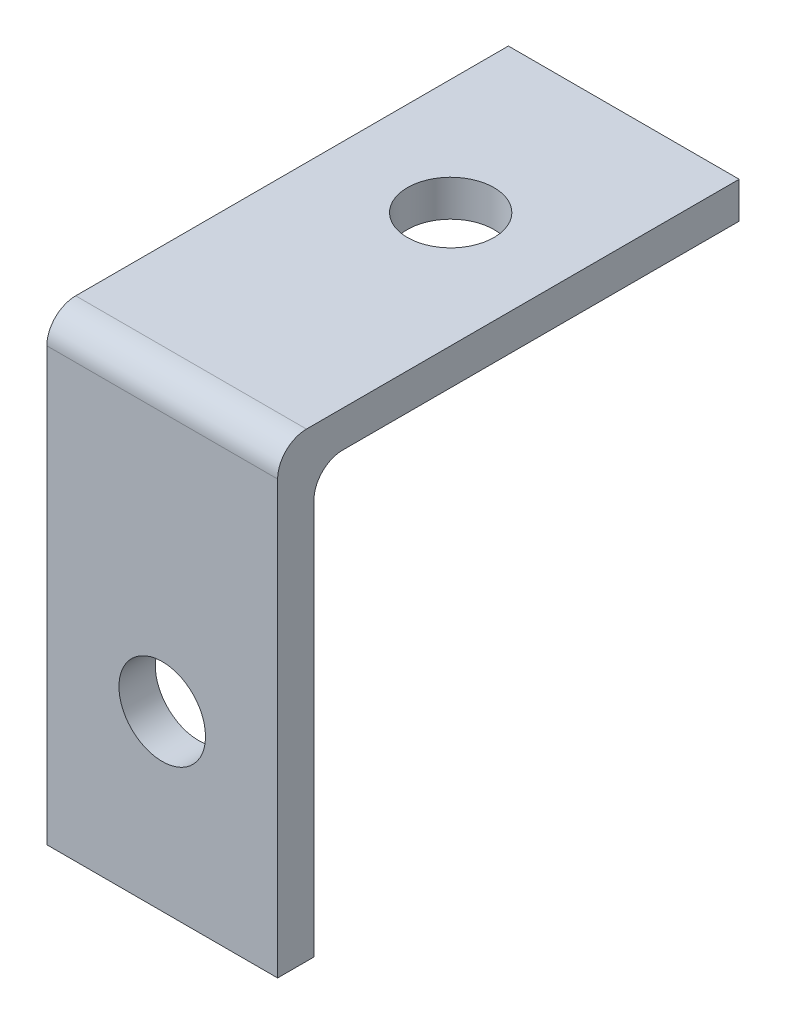
ISO-10303-21;
HEADER;
FILE_DESCRIPTION(('STEP AP214'),'2;1');
FILE_NAME('part.step','',(''),(''),'','','');
FILE_SCHEMA(('AUTOMOTIVE_DESIGN { 1 0 10303 214 1 1 1 1 }'));
ENDSEC;
DATA;
#1=APPLICATION_CONTEXT('core data for automotive mechanical design processes');
#2=APPLICATION_PROTOCOL_DEFINITION('international standard','automotive_design',2000,#1);
#3=PRODUCT_CONTEXT('',#1,'mechanical');
#4=PRODUCT('Part','Part','',(#3));
#5=PRODUCT_RELATED_PRODUCT_CATEGORY('part','',(#4));
#6=PRODUCT_DEFINITION_FORMATION('','',#4);
#7=PRODUCT_DEFINITION_CONTEXT('part definition',#1,'design');
#8=PRODUCT_DEFINITION('design','',#6,#7);
#9=PRODUCT_DEFINITION_SHAPE('','',#8);
#10=(LENGTH_UNIT() NAMED_UNIT(*) SI_UNIT(.MILLI.,.METRE.));
#11=(NAMED_UNIT(*) PLANE_ANGLE_UNIT() SI_UNIT($,.RADIAN.));
#12=(NAMED_UNIT(*) SI_UNIT($,.STERADIAN.) SOLID_ANGLE_UNIT());
#13=UNCERTAINTY_MEASURE_WITH_UNIT(LENGTH_MEASURE(1.E-05),#10,'distance_accuracy_value','');
#14=(GEOMETRIC_REPRESENTATION_CONTEXT(3) GLOBAL_UNCERTAINTY_ASSIGNED_CONTEXT((#13)) GLOBAL_UNIT_ASSIGNED_CONTEXT((#10,
#11,#12)) REPRESENTATION_CONTEXT('',''));
#15=CARTESIAN_POINT('',(0.,0.,0.));
#16=DIRECTION('',(0.,0.,1.));
#17=DIRECTION('',(1.,0.,0.));
#18=AXIS2_PLACEMENT_3D('',#15,#16,#17);
#19=CARTESIAN_POINT('',(0.,0.,0.));
#20=DIRECTION('',(0.,1.,0.));
#21=DIRECTION('',(0.,0.,1.));
#22=AXIS2_PLACEMENT_3D('',#19,#20,#21);
#23=PLANE('',#22);
#24=CARTESIAN_POINT('',(0.,0.,-3.175));
#25=DIRECTION('',(0.,1.,0.));
#26=DIRECTION('',(0.,0.,1.));
#27=AXIS2_PLACEMENT_3D('',#24,#25,#26);
#28=CIRCLE('',#27,2.38125);
#29=CARTESIAN_POINT('',(0.,0.,-0.793750000000001));
#30=VERTEX_POINT('',#29);
#31=EDGE_CURVE('E119',#30,#30,#28,.T.);
#32=ORIENTED_EDGE('',*,*,#31,.T.);
#33=EDGE_LOOP('',(#32));
#34=FACE_BOUND('',#33,.T.);
#35=DIRECTION('',(0.,0.,-1.));
#36=VECTOR('',#35,1.);
#37=CARTESIAN_POINT('',(6.34999999999999,0.,-12.7));
#38=LINE('',#37,#36);
#39=CARTESIAN_POINT('',(6.35,0.,9.11249999999999));
#40=VERTEX_POINT('',#39);
#41=CARTESIAN_POINT('',(6.34999999999999,0.,-12.7));
#42=VERTEX_POINT('',#41);
#43=EDGE_CURVE('E122',#40,#42,#38,.T.);
#44=ORIENTED_EDGE('',*,*,#43,.F.);
#45=DIRECTION('',(1.,0.,0.));
#46=VECTOR('',#45,1.);
#47=CARTESIAN_POINT('',(-6.35,0.,9.11249999999999));
#48=LINE('',#47,#46);
#49=CARTESIAN_POINT('',(-6.35,0.,9.11249999999999));
#50=VERTEX_POINT('',#49);
#51=EDGE_CURVE('E55',#40,#50,#48,.F.);
#52=ORIENTED_EDGE('',*,*,#51,.T.);
#53=DIRECTION('',(0.,0.,1.));
#54=VECTOR('',#53,1.);
#55=CARTESIAN_POINT('',(-6.35000000000001,0.,-12.7));
#56=LINE('',#55,#54);
#57=CARTESIAN_POINT('',(-6.35000000000001,0.,-12.7));
#58=VERTEX_POINT('',#57);
#59=EDGE_CURVE('E132',#58,#50,#56,.T.);
#60=ORIENTED_EDGE('',*,*,#59,.F.);
#61=DIRECTION('',(-1.,0.,0.));
#62=VECTOR('',#61,1.);
#63=CARTESIAN_POINT('',(-6.35000000000001,0.,-12.7));
#64=LINE('',#63,#62);
#65=EDGE_CURVE('E124',#42,#58,#64,.T.);
#66=ORIENTED_EDGE('',*,*,#65,.F.);
#67=EDGE_LOOP('',(#44,#52,#60,#66));
#68=FACE_BOUND('',#67,.T.);
#69=ADVANCED_FACE('F33',(#34,#68),#23,.F.);
#70=CARTESIAN_POINT('',(6.34999999999999,2.,-12.7));
#71=DIRECTION('',(-1.,0.,0.));
#72=DIRECTION('',(0.,0.,1.));
#73=AXIS2_PLACEMENT_3D('',#70,#71,#72);
#74=PLANE('',#73);
#75=DIRECTION('',(0.,0.,-1.));
#76=VECTOR('',#75,1.);
#77=CARTESIAN_POINT('',(6.34999999999999,2.,-12.7));
#78=LINE('',#77,#76);
#79=CARTESIAN_POINT('',(6.35,2.,11.1125));
#80=VERTEX_POINT('',#79);
#81=CARTESIAN_POINT('',(6.34999999999999,2.,-12.7));
#82=VERTEX_POINT('',#81);
#83=EDGE_CURVE('E129',#80,#82,#78,.T.);
#84=ORIENTED_EDGE('',*,*,#83,.F.);
#85=CARTESIAN_POINT('',(6.35,0.4125,11.1125));
#86=DIRECTION('',(-1.,0.,0.));
#87=DIRECTION('',(0.,0.,1.));
#88=AXIS2_PLACEMENT_3D('',#85,#86,#87);
#89=CIRCLE('',#88,1.5875);
#90=CARTESIAN_POINT('',(6.35,0.4125,12.7));
#91=VERTEX_POINT('',#90);
#92=EDGE_CURVE('E152',#80,#91,#89,.F.);
#93=ORIENTED_EDGE('',*,*,#92,.T.);
#94=DIRECTION('',(0.,-1.,0.));
#95=VECTOR('',#94,1.);
#96=CARTESIAN_POINT('',(6.35,2.,12.7));
#97=LINE('',#96,#95);
#98=CARTESIAN_POINT('',(6.35,-23.368,12.7));
#99=VERTEX_POINT('',#98);
#100=EDGE_CURVE('E136',#91,#99,#97,.T.);
#101=ORIENTED_EDGE('',*,*,#100,.T.);
#102=DIRECTION('',(0.,0.,1.));
#103=VECTOR('',#102,1.);
#104=CARTESIAN_POINT('',(6.35,-23.368,12.7));
#105=LINE('',#104,#103);
#106=CARTESIAN_POINT('',(6.35,-23.368,10.7));
#107=VERTEX_POINT('',#106);
#108=EDGE_CURVE('E110',#107,#99,#105,.T.);
#109=ORIENTED_EDGE('',*,*,#108,.F.);
#110=DIRECTION('',(0.,1.,0.));
#111=VECTOR('',#110,1.);
#112=CARTESIAN_POINT('',(6.35,-23.368,10.7));
#113=LINE('',#112,#111);
#114=CARTESIAN_POINT('',(6.35,-1.5875,10.7));
#115=VERTEX_POINT('',#114);
#116=EDGE_CURVE('E106',#107,#115,#113,.T.);
#117=ORIENTED_EDGE('',*,*,#116,.T.);
#118=CARTESIAN_POINT('',(6.35,-1.5875,9.11249999999999));
#119=DIRECTION('',(-1.,0.,0.));
#120=DIRECTION('',(0.,0.,1.));
#121=AXIS2_PLACEMENT_3D('',#118,#119,#120);
#122=CIRCLE('',#121,1.5875);
#123=EDGE_CURVE('E42',#115,#40,#122,.T.);
#124=ORIENTED_EDGE('',*,*,#123,.T.);
#125=ORIENTED_EDGE('',*,*,#43,.T.);
#126=DIRECTION('',(0.,-1.,0.));
#127=VECTOR('',#126,1.);
#128=CARTESIAN_POINT('',(6.34999999999999,2.,-12.7));
#129=LINE('',#128,#127);
#130=EDGE_CURVE('E146',#82,#42,#129,.T.);
#131=ORIENTED_EDGE('',*,*,#130,.F.);
#132=EDGE_LOOP('',(#84,#93,#101,#109,#117,#124,#125,#131));
#133=FACE_BOUND('',#132,.T.);
#134=ADVANCED_FACE('F163',(#133),#74,.F.);
#135=CARTESIAN_POINT('',(-6.35000000000001,2.,-12.7));
#136=DIRECTION('',(0.,0.,1.));
#137=DIRECTION('',(1.,0.,0.));
#138=AXIS2_PLACEMENT_3D('',#135,#136,#137);
#139=PLANE('',#138);
#140=ORIENTED_EDGE('',*,*,#65,.T.);
#141=DIRECTION('',(0.,-1.,0.));
#142=VECTOR('',#141,1.);
#143=CARTESIAN_POINT('',(-6.35000000000001,2.,-12.7));
#144=LINE('',#143,#142);
#145=CARTESIAN_POINT('',(-6.35000000000001,2.,-12.7));
#146=VERTEX_POINT('',#145);
#147=EDGE_CURVE('E143',#146,#58,#144,.T.);
#148=ORIENTED_EDGE('',*,*,#147,.F.);
#149=DIRECTION('',(-1.,0.,0.));
#150=VECTOR('',#149,1.);
#151=CARTESIAN_POINT('',(-6.35000000000001,2.,-12.7));
#152=LINE('',#151,#150);
#153=EDGE_CURVE('E131',#82,#146,#152,.T.);
#154=ORIENTED_EDGE('',*,*,#153,.F.);
#155=ORIENTED_EDGE('',*,*,#130,.T.);
#156=EDGE_LOOP('',(#140,#148,#154,#155));
#157=FACE_BOUND('',#156,.T.);
#158=ADVANCED_FACE('F184',(#157),#139,.F.);
#159=CARTESIAN_POINT('',(-6.35000000000001,2.,-12.7));
#160=DIRECTION('',(1.,0.,0.));
#161=DIRECTION('',(0.,0.,-1.));
#162=AXIS2_PLACEMENT_3D('',#159,#160,#161);
#163=PLANE('',#162);
#164=DIRECTION('',(0.,-1.,0.));
#165=VECTOR('',#164,1.);
#166=CARTESIAN_POINT('',(-6.35,2.,12.7));
#167=LINE('',#166,#165);
#168=CARTESIAN_POINT('',(-6.35,0.4125,12.7));
#169=VERTEX_POINT('',#168);
#170=CARTESIAN_POINT('',(-6.35,-23.368,12.7));
#171=VERTEX_POINT('',#170);
#172=EDGE_CURVE('E141',#169,#171,#167,.T.);
#173=ORIENTED_EDGE('',*,*,#172,.F.);
#174=CARTESIAN_POINT('',(-6.35,0.4125,11.1125));
#175=DIRECTION('',(1.,0.,0.));
#176=DIRECTION('',(0.,0.,-1.));
#177=AXIS2_PLACEMENT_3D('',#174,#175,#176);
#178=CIRCLE('',#177,1.5875);
#179=CARTESIAN_POINT('',(-6.35,2.,11.1125));
#180=VERTEX_POINT('',#179);
#181=EDGE_CURVE('E156',#169,#180,#178,.F.);
#182=ORIENTED_EDGE('',*,*,#181,.T.);
#183=DIRECTION('',(0.,0.,1.));
#184=VECTOR('',#183,1.);
#185=CARTESIAN_POINT('',(-6.35000000000001,2.,-12.7));
#186=LINE('',#185,#184);
#187=EDGE_CURVE('E134',#146,#180,#186,.T.);
#188=ORIENTED_EDGE('',*,*,#187,.F.);
#189=ORIENTED_EDGE('',*,*,#147,.T.);
#190=ORIENTED_EDGE('',*,*,#59,.T.);
#191=CARTESIAN_POINT('',(-6.35,-1.5875,9.11249999999999));
#192=DIRECTION('',(1.,0.,0.));
#193=DIRECTION('',(0.,0.,-1.));
#194=AXIS2_PLACEMENT_3D('',#191,#192,#193);
#195=CIRCLE('',#194,1.5875);
#196=CARTESIAN_POINT('',(-6.35,-1.5875,10.7));
#197=VERTEX_POINT('',#196);
#198=EDGE_CURVE('E12',#50,#197,#195,.T.);
#199=ORIENTED_EDGE('',*,*,#198,.T.);
#200=DIRECTION('',(0.,1.,0.));
#201=VECTOR('',#200,1.);
#202=CARTESIAN_POINT('',(-6.35,-23.368,10.7));
#203=LINE('',#202,#201);
#204=CARTESIAN_POINT('',(-6.35,-23.368,10.7));
#205=VERTEX_POINT('',#204);
#206=EDGE_CURVE('E103',#205,#197,#203,.T.);
#207=ORIENTED_EDGE('',*,*,#206,.F.);
#208=DIRECTION('',(0.,0.,-1.));
#209=VECTOR('',#208,1.);
#210=CARTESIAN_POINT('',(-6.35,-23.368,12.7));
#211=LINE('',#210,#209);
#212=EDGE_CURVE('E111',#171,#205,#211,.T.);
#213=ORIENTED_EDGE('',*,*,#212,.F.);
#214=EDGE_LOOP('',(#173,#182,#188,#189,#190,#199,#207,#213));
#215=FACE_BOUND('',#214,.T.);
#216=ADVANCED_FACE('F121',(#215),#163,.F.);
#217=CARTESIAN_POINT('',(-6.35,2.,12.7));
#218=DIRECTION('',(0.,0.,-1.));
#219=DIRECTION('',(-1.,0.,0.));
#220=AXIS2_PLACEMENT_3D('',#217,#218,#219);
#221=PLANE('',#220);
#222=CARTESIAN_POINT('',(0.,-13.843,12.7));
#223=DIRECTION('',(0.,0.,1.));
#224=DIRECTION('',(1.,0.,0.));
#225=AXIS2_PLACEMENT_3D('',#222,#223,#224);
#226=CIRCLE('',#225,2.38125);
#227=CARTESIAN_POINT('',(2.38125,-13.843,12.7));
#228=VERTEX_POINT('',#227);
#229=EDGE_CURVE('E216',#228,#228,#226,.T.);
#230=ORIENTED_EDGE('',*,*,#229,.F.);
#231=EDGE_LOOP('',(#230));
#232=FACE_BOUND('',#231,.T.);
#233=ORIENTED_EDGE('',*,*,#100,.F.);
#234=DIRECTION('',(1.,0.,0.));
#235=VECTOR('',#234,1.);
#236=CARTESIAN_POINT('',(-6.35,0.4125,12.7));
#237=LINE('',#236,#235);
#238=EDGE_CURVE('E154',#91,#169,#237,.F.);
#239=ORIENTED_EDGE('',*,*,#238,.T.);
#240=ORIENTED_EDGE('',*,*,#172,.T.);
#241=DIRECTION('',(-1.,0.,0.));
#242=VECTOR('',#241,1.);
#243=CARTESIAN_POINT('',(-6.35,-23.368,12.7));
#244=LINE('',#243,#242);
#245=EDGE_CURVE('E117',#99,#171,#244,.T.);
#246=ORIENTED_EDGE('',*,*,#245,.F.);
#247=EDGE_LOOP('',(#233,#239,#240,#246));
#248=FACE_BOUND('',#247,.T.);
#249=ADVANCED_FACE('F191',(#232,#248),#221,.F.);
#250=CARTESIAN_POINT('',(0.,2.,0.));
#251=DIRECTION('',(0.,1.,0.));
#252=DIRECTION('',(0.,0.,1.));
#253=AXIS2_PLACEMENT_3D('',#250,#251,#252);
#254=PLANE('',#253);
#255=CARTESIAN_POINT('',(0.,2.,-3.175));
#256=DIRECTION('',(0.,1.,0.));
#257=DIRECTION('',(0.,0.,1.));
#258=AXIS2_PLACEMENT_3D('',#255,#256,#257);
#259=CIRCLE('',#258,2.38125);
#260=CARTESIAN_POINT('',(0.,2.,-0.793750000000001));
#261=VERTEX_POINT('',#260);
#262=EDGE_CURVE('E213',#261,#261,#259,.T.);
#263=ORIENTED_EDGE('',*,*,#262,.F.);
#264=EDGE_LOOP('',(#263));
#265=FACE_BOUND('',#264,.T.);
#266=ORIENTED_EDGE('',*,*,#187,.T.);
#267=DIRECTION('',(1.,0.,0.));
#268=VECTOR('',#267,1.);
#269=CARTESIAN_POINT('',(6.35,2.,11.1125));
#270=LINE('',#269,#268);
#271=EDGE_CURVE('E149',#180,#80,#270,.T.);
#272=ORIENTED_EDGE('',*,*,#271,.T.);
#273=ORIENTED_EDGE('',*,*,#83,.T.);
#274=ORIENTED_EDGE('',*,*,#153,.T.);
#275=EDGE_LOOP('',(#266,#272,#273,#274));
#276=FACE_BOUND('',#275,.T.);
#277=ADVANCED_FACE('F189',(#265,#276),#254,.T.);
#278=CARTESIAN_POINT('',(-6.35,-23.368,10.7));
#279=DIRECTION('',(0.,0.,1.));
#280=DIRECTION('',(1.,0.,0.));
#281=AXIS2_PLACEMENT_3D('',#278,#279,#280);
#282=PLANE('',#281);
#283=CARTESIAN_POINT('',(0.,-13.843,10.7));
#284=DIRECTION('',(0.,0.,1.));
#285=DIRECTION('',(1.,0.,0.));
#286=AXIS2_PLACEMENT_3D('',#283,#284,#285);
#287=CIRCLE('',#286,2.38125);
#288=CARTESIAN_POINT('',(2.38125,-13.843,10.7));
#289=VERTEX_POINT('',#288);
#290=EDGE_CURVE('E37',#289,#289,#287,.T.);
#291=ORIENTED_EDGE('',*,*,#290,.T.);
#292=EDGE_LOOP('',(#291));
#293=FACE_BOUND('',#292,.T.);
#294=ORIENTED_EDGE('',*,*,#206,.T.);
#295=DIRECTION('',(1.,0.,0.));
#296=VECTOR('',#295,1.);
#297=CARTESIAN_POINT('',(6.35,-1.5875,10.7));
#298=LINE('',#297,#296);
#299=EDGE_CURVE('E158',#197,#115,#298,.T.);
#300=ORIENTED_EDGE('',*,*,#299,.T.);
#301=ORIENTED_EDGE('',*,*,#116,.F.);
#302=DIRECTION('',(1.,0.,0.));
#303=VECTOR('',#302,1.);
#304=CARTESIAN_POINT('',(-6.35,-23.368,10.7));
#305=LINE('',#304,#303);
#306=EDGE_CURVE('E99',#205,#107,#305,.T.);
#307=ORIENTED_EDGE('',*,*,#306,.F.);
#308=EDGE_LOOP('',(#294,#300,#301,#307));
#309=FACE_BOUND('',#308,.T.);
#310=ADVANCED_FACE('F101',(#293,#309),#282,.F.);
#311=CARTESIAN_POINT('',(0.,-23.368,0.));
#312=DIRECTION('',(0.,-1.,0.));
#313=DIRECTION('',(0.,0.,-1.));
#314=AXIS2_PLACEMENT_3D('',#311,#312,#313);
#315=PLANE('',#314);
#316=ORIENTED_EDGE('',*,*,#212,.T.);
#317=ORIENTED_EDGE('',*,*,#306,.T.);
#318=ORIENTED_EDGE('',*,*,#108,.T.);
#319=ORIENTED_EDGE('',*,*,#245,.T.);
#320=EDGE_LOOP('',(#316,#317,#318,#319));
#321=FACE_BOUND('',#320,.T.);
#322=ADVANCED_FACE('F115',(#321),#315,.T.);
#323=CARTESIAN_POINT('',(0.,0.4125,11.1125));
#324=DIRECTION('',(-1.,0.,0.));
#325=DIRECTION('',(0.,0.,1.));
#326=AXIS2_PLACEMENT_3D('',#323,#324,#325);
#327=CYLINDRICAL_SURFACE('',#326,1.5875);
#328=ORIENTED_EDGE('',*,*,#181,.F.);
#329=ORIENTED_EDGE('',*,*,#238,.F.);
#330=ORIENTED_EDGE('',*,*,#92,.F.);
#331=ORIENTED_EDGE('',*,*,#271,.F.);
#332=EDGE_LOOP('',(#328,#329,#330,#331));
#333=FACE_BOUND('',#332,.T.);
#334=ADVANCED_FACE('F169',(#333),#327,.T.);
#335=CARTESIAN_POINT('',(-6.35,-1.5875,9.11249999999999));
#336=DIRECTION('',(-1.,0.,0.));
#337=DIRECTION('',(0.,0.,1.));
#338=AXIS2_PLACEMENT_3D('',#335,#336,#337);
#339=CYLINDRICAL_SURFACE('',#338,1.5875);
#340=ORIENTED_EDGE('',*,*,#198,.F.);
#341=ORIENTED_EDGE('',*,*,#51,.F.);
#342=ORIENTED_EDGE('',*,*,#123,.F.);
#343=ORIENTED_EDGE('',*,*,#299,.F.);
#344=EDGE_LOOP('',(#340,#341,#342,#343));
#345=FACE_BOUND('',#344,.T.);
#346=ADVANCED_FACE('F35',(#345),#339,.F.);
#347=CARTESIAN_POINT('',(0.,-23.368,-3.175));
#348=DIRECTION('',(0.,1.,0.));
#349=DIRECTION('',(0.,0.,1.));
#350=AXIS2_PLACEMENT_3D('',#347,#348,#349);
#351=CYLINDRICAL_SURFACE('',#350,2.38125);
#352=ORIENTED_EDGE('',*,*,#262,.T.);
#353=EDGE_LOOP('',(#352));
#354=FACE_BOUND('',#353,.T.);
#355=ORIENTED_EDGE('',*,*,#31,.F.);
#356=EDGE_LOOP('',(#355));
#357=FACE_BOUND('',#356,.T.);
#358=ADVANCED_FACE('F168',(#354,#357),#351,.F.);
#359=CARTESIAN_POINT('',(0.,-13.843,10.16));
#360=DIRECTION('',(0.,0.,1.));
#361=DIRECTION('',(1.,0.,0.));
#362=AXIS2_PLACEMENT_3D('',#359,#360,#361);
#363=CYLINDRICAL_SURFACE('',#362,2.38125);
#364=ORIENTED_EDGE('',*,*,#229,.T.);
#365=EDGE_LOOP('',(#364));
#366=FACE_BOUND('',#365,.T.);
#367=ORIENTED_EDGE('',*,*,#290,.F.);
#368=EDGE_LOOP('',(#367));
#369=FACE_BOUND('',#368,.T.);
#370=ADVANCED_FACE('F174',(#366,#369),#363,.F.);
#371=CLOSED_SHELL('',(#69,#134,#158,#216,#249,#277,#310,#322,#334,#346,#358,#370));
#372=MANIFOLD_SOLID_BREP('B2',#371);
#373=ADVANCED_BREP_SHAPE_REPRESENTATION('',(#18,#372),#14);
#374=SHAPE_DEFINITION_REPRESENTATION(#9,#373);
ENDSEC;
END-ISO-10303-21;
